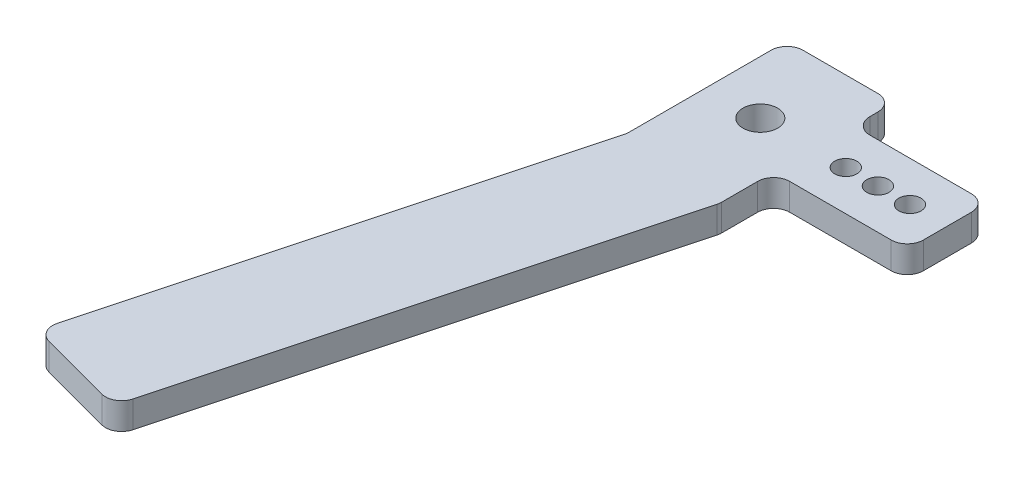
ISO-10303-21;
HEADER;
FILE_DESCRIPTION(('STEP AP214'),'2;1');
FILE_NAME('part.step','',(''),(''),'','','');
FILE_SCHEMA(('AUTOMOTIVE_DESIGN { 1 0 10303 214 1 1 1 1 }'));
ENDSEC;
DATA;
#1=APPLICATION_CONTEXT('core data for automotive mechanical design processes');
#2=APPLICATION_PROTOCOL_DEFINITION('international standard','automotive_design',2000,#1);
#3=PRODUCT_CONTEXT('',#1,'mechanical');
#4=PRODUCT('Part','Part','',(#3));
#5=PRODUCT_RELATED_PRODUCT_CATEGORY('part','',(#4));
#6=PRODUCT_DEFINITION_FORMATION('','',#4);
#7=PRODUCT_DEFINITION_CONTEXT('part definition',#1,'design');
#8=PRODUCT_DEFINITION('design','',#6,#7);
#9=PRODUCT_DEFINITION_SHAPE('','',#8);
#10=(LENGTH_UNIT() NAMED_UNIT(*) SI_UNIT(.MILLI.,.METRE.));
#11=(NAMED_UNIT(*) PLANE_ANGLE_UNIT() SI_UNIT($,.RADIAN.));
#12=(NAMED_UNIT(*) SI_UNIT($,.STERADIAN.) SOLID_ANGLE_UNIT());
#13=UNCERTAINTY_MEASURE_WITH_UNIT(LENGTH_MEASURE(1.E-05),#10,'distance_accuracy_value','');
#14=(GEOMETRIC_REPRESENTATION_CONTEXT(3) GLOBAL_UNCERTAINTY_ASSIGNED_CONTEXT((#13)) GLOBAL_UNIT_ASSIGNED_CONTEXT((#10,
#11,#12)) REPRESENTATION_CONTEXT('',''));
#15=CARTESIAN_POINT('',(0.,0.,0.));
#16=DIRECTION('',(0.,0.,1.));
#17=DIRECTION('',(1.,0.,0.));
#18=AXIS2_PLACEMENT_3D('',#15,#16,#17);
#19=CARTESIAN_POINT('',(-39.15,5.,-15.));
#20=DIRECTION('',(-1.,0.,0.));
#21=DIRECTION('',(0.,0.,1.));
#22=AXIS2_PLACEMENT_3D('',#19,#20,#21);
#23=PLANE('',#22);
#24=DIRECTION('',(0.,0.,-1.));
#25=VECTOR('',#24,1.);
#26=CARTESIAN_POINT('',(-39.15,0.,-15.));
#27=LINE('',#26,#25);
#28=CARTESIAN_POINT('',(-39.15,0.,17.2380924589857));
#29=VERTEX_POINT('',#28);
#30=CARTESIAN_POINT('',(-39.15,0.,10.5));
#31=VERTEX_POINT('',#30);
#32=EDGE_CURVE('E319',#29,#31,#27,.T.);
#33=ORIENTED_EDGE('',*,*,#32,.T.);
#34=DIRECTION('',(0.,-1.,0.));
#35=VECTOR('',#34,1.);
#36=CARTESIAN_POINT('',(-39.15,5.,10.5));
#37=LINE('',#36,#35);
#38=CARTESIAN_POINT('',(-39.15,5.,10.5));
#39=VERTEX_POINT('',#38);
#40=EDGE_CURVE('E241',#31,#39,#37,.F.);
#41=ORIENTED_EDGE('',*,*,#40,.T.);
#42=DIRECTION('',(0.,0.,-1.));
#43=VECTOR('',#42,1.);
#44=CARTESIAN_POINT('',(-39.15,5.,15.));
#45=LINE('',#44,#43);
#46=CARTESIAN_POINT('',(-39.15,5.,17.2380924589857));
#47=VERTEX_POINT('',#46);
#48=EDGE_CURVE('E330',#47,#39,#45,.T.);
#49=ORIENTED_EDGE('',*,*,#48,.F.);
#50=DIRECTION('',(0.,-1.,0.));
#51=VECTOR('',#50,1.);
#52=CARTESIAN_POINT('',(-39.15,5.,17.2380924589857));
#53=LINE('',#52,#51);
#54=EDGE_CURVE('E238',#47,#29,#53,.T.);
#55=ORIENTED_EDGE('',*,*,#54,.T.);
#56=EDGE_LOOP('',(#33,#41,#49,#55));
#57=FACE_BOUND('',#56,.T.);
#58=ADVANCED_FACE('F37',(#57),#23,.F.);
#59=CARTESIAN_POINT('',(0.,5.,0.));
#60=DIRECTION('',(0.,1.,0.));
#61=DIRECTION('',(0.,0.,1.));
#62=AXIS2_PLACEMENT_3D('',#59,#60,#61);
#63=PLANE('',#62);
#64=DIRECTION('',(0.,0.,-1.));
#65=VECTOR('',#64,1.);
#66=CARTESIAN_POINT('',(-14.15,5.,0.));
#67=LINE('',#66,#65);
#68=CARTESIAN_POINT('',(-14.15,5.,4.5));
#69=VERTEX_POINT('',#68);
#70=CARTESIAN_POINT('',(-14.15,5.,-4.5));
#71=VERTEX_POINT('',#70);
#72=EDGE_CURVE('E182',#69,#71,#67,.T.);
#73=ORIENTED_EDGE('',*,*,#72,.T.);
#74=CARTESIAN_POINT('',(-17.15,5.,-4.5));
#75=DIRECTION('',(0.,1.,0.));
#76=DIRECTION('',(0.,0.,1.));
#77=AXIS2_PLACEMENT_3D('',#74,#75,#76);
#78=CIRCLE('',#77,3.);
#79=CARTESIAN_POINT('',(-17.15,5.,-7.5));
#80=VERTEX_POINT('',#79);
#81=EDGE_CURVE('E175',#71,#80,#78,.T.);
#82=ORIENTED_EDGE('',*,*,#81,.T.);
#83=DIRECTION('',(-1.,0.,0.));
#84=VECTOR('',#83,1.);
#85=CARTESIAN_POINT('',(0.,5.,-7.5));
#86=LINE('',#85,#84);
#87=CARTESIAN_POINT('',(-36.15,5.,-7.5));
#88=VERTEX_POINT('',#87);
#89=EDGE_CURVE('E179',#80,#88,#86,.T.);
#90=ORIENTED_EDGE('',*,*,#89,.T.);
#91=CARTESIAN_POINT('',(-36.15,5.,-10.5));
#92=DIRECTION('',(0.,1.,0.));
#93=DIRECTION('',(0.,0.,1.));
#94=AXIS2_PLACEMENT_3D('',#91,#92,#93);
#95=CIRCLE('',#94,3.);
#96=CARTESIAN_POINT('',(-39.1500000000001,5.,-10.5));
#97=VERTEX_POINT('',#96);
#98=EDGE_CURVE('E278',#88,#97,#95,.F.);
#99=ORIENTED_EDGE('',*,*,#98,.T.);
#100=CARTESIAN_POINT('',(-39.1500000000001,5.,-12.));
#101=VERTEX_POINT('',#100);
#102=EDGE_CURVE('E327',#97,#101,#45,.T.);
#103=ORIENTED_EDGE('',*,*,#102,.T.);
#104=CARTESIAN_POINT('',(-42.15,5.,-12.));
#105=DIRECTION('',(0.,1.,0.));
#106=DIRECTION('',(0.,0.,1.));
#107=AXIS2_PLACEMENT_3D('',#104,#105,#106);
#108=CIRCLE('',#107,3.);
#109=CARTESIAN_POINT('',(-42.15,5.,-15.));
#110=VERTEX_POINT('',#109);
#111=EDGE_CURVE('E229',#101,#110,#108,.T.);
#112=ORIENTED_EDGE('',*,*,#111,.T.);
#113=DIRECTION('',(-1.,0.,0.));
#114=VECTOR('',#113,1.);
#115=CARTESIAN_POINT('',(-59.15,5.,-15.));
#116=LINE('',#115,#114);
#117=CARTESIAN_POINT('',(-56.15,5.,-15.));
#118=VERTEX_POINT('',#117);
#119=EDGE_CURVE('E311',#110,#118,#116,.T.);
#120=ORIENTED_EDGE('',*,*,#119,.T.);
#121=CARTESIAN_POINT('',(-56.15,5.,-12.));
#122=DIRECTION('',(0.,1.,0.));
#123=DIRECTION('',(0.,0.,1.));
#124=AXIS2_PLACEMENT_3D('',#121,#122,#123);
#125=CIRCLE('',#124,3.);
#126=CARTESIAN_POINT('',(-59.15,5.,-12.));
#127=VERTEX_POINT('',#126);
#128=EDGE_CURVE('E231',#118,#127,#125,.T.);
#129=ORIENTED_EDGE('',*,*,#128,.T.);
#130=DIRECTION('',(0.,0.,1.));
#131=VECTOR('',#130,1.);
#132=CARTESIAN_POINT('',(-59.15,5.,-15.));
#133=LINE('',#132,#131);
#134=CARTESIAN_POINT('',(-59.15,5.,14.6050425072378));
#135=VERTEX_POINT('',#134);
#136=EDGE_CURVE('E304',#127,#135,#133,.T.);
#137=ORIENTED_EDGE('',*,*,#136,.T.);
#138=CARTESIAN_POINT('',(-62.15,5.,14.6050425072378));
#139=DIRECTION('',(0.,1.,0.));
#140=DIRECTION('',(0.,0.,1.));
#141=AXIS2_PLACEMENT_3D('',#138,#139,#140);
#142=CIRCLE('',#141,3.);
#143=CARTESIAN_POINT('',(-59.2522225211328,5.,15.3814996425454));
#144=VERTEX_POINT('',#143);
#145=EDGE_CURVE('E11',#135,#144,#142,.F.);
#146=ORIENTED_EDGE('',*,*,#145,.T.);
#147=DIRECTION('',(-0.258819045102521,0.,0.965925826289068));
#148=VECTOR('',#147,1.);
#149=CARTESIAN_POINT('',(-59.15,5.,15.));
#150=LINE('',#149,#148);
#151=CARTESIAN_POINT('',(-81.6672569239194,5.,99.0355468871489));
#152=VERTEX_POINT('',#151);
#153=EDGE_CURVE('E302',#144,#152,#150,.T.);
#154=ORIENTED_EDGE('',*,*,#153,.T.);
#155=CARTESIAN_POINT('',(-78.7694794450521,5.,99.8120040224565));
#156=DIRECTION('',(0.,1.,0.));
#157=DIRECTION('',(0.,0.,1.));
#158=AXIS2_PLACEMENT_3D('',#155,#156,#157);
#159=CIRCLE('',#158,3.);
#160=CARTESIAN_POINT('',(-79.5459365803597,5.,102.709781501324));
#161=VERTEX_POINT('',#160);
#162=EDGE_CURVE('E225',#152,#161,#159,.T.);
#163=ORIENTED_EDGE('',*,*,#162,.T.);
#164=DIRECTION('',(0.965925826289068,0.,0.25881904510252));
#165=VECTOR('',#164,1.);
#166=CARTESIAN_POINT('',(-82.4437140592269,5.,101.933324366016));
#167=LINE('',#166,#165);
#168=CARTESIAN_POINT('',(-66.0229750123128,5.,106.333248132759));
#169=VERTEX_POINT('',#168);
#170=EDGE_CURVE('E308',#161,#169,#167,.T.);
#171=ORIENTED_EDGE('',*,*,#170,.T.);
#172=CARTESIAN_POINT('',(-65.2465178770052,5.,103.435470653892));
#173=DIRECTION('',(0.,1.,0.));
#174=DIRECTION('',(0.,0.,1.));
#175=AXIS2_PLACEMENT_3D('',#172,#173,#174);
#176=CIRCLE('',#175,3.);
#177=CARTESIAN_POINT('',(-62.348740398138,5.,104.211927789199));
#178=VERTEX_POINT('',#177);
#179=EDGE_CURVE('E59',#169,#178,#176,.T.);
#180=ORIENTED_EDGE('',*,*,#179,.T.);
#181=DIRECTION('',(0.258819045102521,0.,-0.965925826289068));
#182=VECTOR('',#181,1.);
#183=CARTESIAN_POINT('',(-39.8314834742186,5.,20.1763809020504));
#184=LINE('',#183,#182);
#185=CARTESIAN_POINT('',(-39.2522225211328,5.,18.0145495942933));
#186=VERTEX_POINT('',#185);
#187=EDGE_CURVE('E205',#178,#186,#184,.T.);
#188=ORIENTED_EDGE('',*,*,#187,.T.);
#189=CARTESIAN_POINT('',(-42.15,5.,17.2380924589857));
#190=DIRECTION('',(0.,1.,0.));
#191=DIRECTION('',(0.,0.,1.));
#192=AXIS2_PLACEMENT_3D('',#189,#190,#191);
#193=CIRCLE('',#192,3.);
#194=EDGE_CURVE('E227',#186,#47,#193,.T.);
#195=ORIENTED_EDGE('',*,*,#194,.T.);
#196=ORIENTED_EDGE('',*,*,#48,.T.);
#197=CARTESIAN_POINT('',(-36.15,5.,10.5));
#198=DIRECTION('',(0.,1.,0.));
#199=DIRECTION('',(0.,0.,1.));
#200=AXIS2_PLACEMENT_3D('',#197,#198,#199);
#201=CIRCLE('',#200,3.);
#202=CARTESIAN_POINT('',(-36.15,5.,7.49999999999999));
#203=VERTEX_POINT('',#202);
#204=EDGE_CURVE('E274',#39,#203,#201,.F.);
#205=ORIENTED_EDGE('',*,*,#204,.T.);
#206=DIRECTION('',(-1.,0.,0.));
#207=VECTOR('',#206,1.);
#208=CARTESIAN_POINT('',(0.,5.,7.5));
#209=LINE('',#208,#207);
#210=CARTESIAN_POINT('',(-17.15,5.,7.5));
#211=VERTEX_POINT('',#210);
#212=EDGE_CURVE('E358',#211,#203,#209,.T.);
#213=ORIENTED_EDGE('',*,*,#212,.F.);
#214=CARTESIAN_POINT('',(-17.15,5.,4.5));
#215=DIRECTION('',(0.,1.,0.));
#216=DIRECTION('',(0.,0.,1.));
#217=AXIS2_PLACEMENT_3D('',#214,#215,#216);
#218=CIRCLE('',#217,3.);
#219=EDGE_CURVE('E187',#211,#69,#218,.T.);
#220=ORIENTED_EDGE('',*,*,#219,.T.);
#221=EDGE_LOOP('',(#73,#82,#90,#99,#103,#112,#120,#129,#137,#146,#154,#163,#171,#180,#188,#195,
#196,#205,#213,#220));
#222=FACE_BOUND('',#221,.T.);
#223=CARTESIAN_POINT('',(-49.15,5.,0.));
#224=DIRECTION('',(0.,1.,0.));
#225=DIRECTION('',(0.,0.,1.));
#226=AXIS2_PLACEMENT_3D('',#223,#224,#225);
#227=CIRCLE('',#226,3.25);
#228=CARTESIAN_POINT('',(-49.15,5.,3.25));
#229=VERTEX_POINT('',#228);
#230=EDGE_CURVE('E320',#229,#229,#227,.T.);
#231=ORIENTED_EDGE('',*,*,#230,.F.);
#232=EDGE_LOOP('',(#231));
#233=FACE_BOUND('',#232,.T.);
#234=CARTESIAN_POINT('',(-27.15,5.,0.));
#235=DIRECTION('',(0.,1.,0.));
#236=DIRECTION('',(0.,0.,1.));
#237=AXIS2_PLACEMENT_3D('',#234,#235,#236);
#238=CIRCLE('',#237,2.075);
#239=CARTESIAN_POINT('',(-27.15,5.,2.075));
#240=VERTEX_POINT('',#239);
#241=EDGE_CURVE('E380',#240,#240,#238,.F.);
#242=ORIENTED_EDGE('',*,*,#241,.T.);
#243=EDGE_LOOP('',(#242));
#244=FACE_BOUND('',#243,.T.);
#245=CARTESIAN_POINT('',(-21.15,5.,0.));
#246=DIRECTION('',(0.,1.,0.));
#247=DIRECTION('',(0.,0.,1.));
#248=AXIS2_PLACEMENT_3D('',#245,#246,#247);
#249=CIRCLE('',#248,2.075);
#250=CARTESIAN_POINT('',(-21.15,5.,2.075));
#251=VERTEX_POINT('',#250);
#252=EDGE_CURVE('E197',#251,#251,#249,.F.);
#253=ORIENTED_EDGE('',*,*,#252,.T.);
#254=EDGE_LOOP('',(#253));
#255=FACE_BOUND('',#254,.T.);
#256=CARTESIAN_POINT('',(-33.15,5.,0.));
#257=DIRECTION('',(0.,1.,0.));
#258=DIRECTION('',(0.,0.,1.));
#259=AXIS2_PLACEMENT_3D('',#256,#257,#258);
#260=CIRCLE('',#259,2.075);
#261=CARTESIAN_POINT('',(-33.15,5.,2.075));
#262=VERTEX_POINT('',#261);
#263=EDGE_CURVE('E375',#262,#262,#260,.F.);
#264=ORIENTED_EDGE('',*,*,#263,.T.);
#265=EDGE_LOOP('',(#264));
#266=FACE_BOUND('',#265,.T.);
#267=ADVANCED_FACE('F177',(#222,#233,#244,#255,#266),#63,.T.);
#268=CARTESIAN_POINT('',(0.,0.,0.));
#269=DIRECTION('',(0.,1.,0.));
#270=DIRECTION('',(0.,0.,1.));
#271=AXIS2_PLACEMENT_3D('',#268,#269,#270);
#272=PLANE('',#271);
#273=DIRECTION('',(-1.,0.,0.));
#274=VECTOR('',#273,1.);
#275=CARTESIAN_POINT('',(0.,0.,-7.5));
#276=LINE('',#275,#274);
#277=CARTESIAN_POINT('',(-17.15,0.,-7.5));
#278=VERTEX_POINT('',#277);
#279=CARTESIAN_POINT('',(-36.15,0.,-7.5));
#280=VERTEX_POINT('',#279);
#281=EDGE_CURVE('E357',#278,#280,#276,.T.);
#282=ORIENTED_EDGE('',*,*,#281,.F.);
#283=CARTESIAN_POINT('',(-17.15,0.,-4.5));
#284=DIRECTION('',(0.,1.,0.));
#285=DIRECTION('',(0.,0.,1.));
#286=AXIS2_PLACEMENT_3D('',#283,#284,#285);
#287=CIRCLE('',#286,3.);
#288=CARTESIAN_POINT('',(-14.15,0.,-4.5));
#289=VERTEX_POINT('',#288);
#290=EDGE_CURVE('E200',#278,#289,#287,.F.);
#291=ORIENTED_EDGE('',*,*,#290,.T.);
#292=DIRECTION('',(0.,0.,-1.));
#293=VECTOR('',#292,1.);
#294=CARTESIAN_POINT('',(-14.15,0.,0.));
#295=LINE('',#294,#293);
#296=CARTESIAN_POINT('',(-14.15,0.,4.5));
#297=VERTEX_POINT('',#296);
#298=EDGE_CURVE('E365',#297,#289,#295,.T.);
#299=ORIENTED_EDGE('',*,*,#298,.F.);
#300=CARTESIAN_POINT('',(-17.15,0.,4.5));
#301=DIRECTION('',(0.,1.,0.));
#302=DIRECTION('',(0.,0.,1.));
#303=AXIS2_PLACEMENT_3D('',#300,#301,#302);
#304=CIRCLE('',#303,3.);
#305=CARTESIAN_POINT('',(-17.15,0.,7.5));
#306=VERTEX_POINT('',#305);
#307=EDGE_CURVE('E216',#297,#306,#304,.F.);
#308=ORIENTED_EDGE('',*,*,#307,.T.);
#309=DIRECTION('',(-1.,0.,0.));
#310=VECTOR('',#309,1.);
#311=CARTESIAN_POINT('',(0.,0.,7.5));
#312=LINE('',#311,#310);
#313=CARTESIAN_POINT('',(-36.15,0.,7.49999999999999));
#314=VERTEX_POINT('',#313);
#315=EDGE_CURVE('E382',#306,#314,#312,.T.);
#316=ORIENTED_EDGE('',*,*,#315,.T.);
#317=CARTESIAN_POINT('',(-36.15,0.,10.5));
#318=DIRECTION('',(0.,1.,0.));
#319=DIRECTION('',(0.,0.,1.));
#320=AXIS2_PLACEMENT_3D('',#317,#318,#319);
#321=CIRCLE('',#320,3.);
#322=EDGE_CURVE('E272',#314,#31,#321,.T.);
#323=ORIENTED_EDGE('',*,*,#322,.T.);
#324=ORIENTED_EDGE('',*,*,#32,.F.);
#325=CARTESIAN_POINT('',(-42.15,0.,17.2380924589857));
#326=DIRECTION('',(0.,1.,0.));
#327=DIRECTION('',(0.,0.,1.));
#328=AXIS2_PLACEMENT_3D('',#325,#326,#327);
#329=CIRCLE('',#328,3.);
#330=CARTESIAN_POINT('',(-39.2522225211328,0.,18.0145495942933));
#331=VERTEX_POINT('',#330);
#332=EDGE_CURVE('E210',#29,#331,#329,.F.);
#333=ORIENTED_EDGE('',*,*,#332,.T.);
#334=DIRECTION('',(0.258819045102522,0.,-0.965925826289068));
#335=VECTOR('',#334,1.);
#336=CARTESIAN_POINT('',(-39.8314834742186,0.,20.1763809020504));
#337=LINE('',#336,#335);
#338=CARTESIAN_POINT('',(-62.348740398138,0.,104.211927789199));
#339=VERTEX_POINT('',#338);
#340=EDGE_CURVE('E326',#339,#331,#337,.T.);
#341=ORIENTED_EDGE('',*,*,#340,.F.);
#342=CARTESIAN_POINT('',(-65.2465178770052,0.,103.435470653892));
#343=DIRECTION('',(0.,1.,0.));
#344=DIRECTION('',(0.,0.,1.));
#345=AXIS2_PLACEMENT_3D('',#342,#343,#344);
#346=CIRCLE('',#345,3.);
#347=CARTESIAN_POINT('',(-66.0229750123128,0.,106.333248132759));
#348=VERTEX_POINT('',#347);
#349=EDGE_CURVE('E201',#339,#348,#346,.F.);
#350=ORIENTED_EDGE('',*,*,#349,.T.);
#351=DIRECTION('',(0.965925826289068,0.,0.25881904510252));
#352=VECTOR('',#351,1.);
#353=CARTESIAN_POINT('',(-82.4437140592269,0.,101.933324366016));
#354=LINE('',#353,#352);
#355=CARTESIAN_POINT('',(-79.5459365803597,0.,102.709781501324));
#356=VERTEX_POINT('',#355);
#357=EDGE_CURVE('E324',#356,#348,#354,.T.);
#358=ORIENTED_EDGE('',*,*,#357,.F.);
#359=CARTESIAN_POINT('',(-78.7694794450521,0.,99.8120040224565));
#360=DIRECTION('',(0.,1.,0.));
#361=DIRECTION('',(0.,0.,1.));
#362=AXIS2_PLACEMENT_3D('',#359,#360,#361);
#363=CIRCLE('',#362,3.);
#364=CARTESIAN_POINT('',(-81.6672569239194,0.,99.0355468871489));
#365=VERTEX_POINT('',#364);
#366=EDGE_CURVE('E203',#356,#365,#363,.F.);
#367=ORIENTED_EDGE('',*,*,#366,.T.);
#368=DIRECTION('',(-0.258819045102521,0.,0.965925826289068));
#369=VECTOR('',#368,1.);
#370=CARTESIAN_POINT('',(-59.15,0.,15.));
#371=LINE('',#370,#369);
#372=CARTESIAN_POINT('',(-59.2522225211328,0.,15.3814996425454));
#373=VERTEX_POINT('',#372);
#374=EDGE_CURVE('E287',#373,#365,#371,.T.);
#375=ORIENTED_EDGE('',*,*,#374,.F.);
#376=CARTESIAN_POINT('',(-62.15,0.,14.6050425072378));
#377=DIRECTION('',(0.,1.,0.));
#378=DIRECTION('',(0.,0.,1.));
#379=AXIS2_PLACEMENT_3D('',#376,#377,#378);
#380=CIRCLE('',#379,3.);
#381=CARTESIAN_POINT('',(-59.15,0.,14.6050425072378));
#382=VERTEX_POINT('',#381);
#383=EDGE_CURVE('E45',#373,#382,#380,.T.);
#384=ORIENTED_EDGE('',*,*,#383,.T.);
#385=DIRECTION('',(0.,0.,1.));
#386=VECTOR('',#385,1.);
#387=CARTESIAN_POINT('',(-59.15,0.,-15.));
#388=LINE('',#387,#386);
#389=CARTESIAN_POINT('',(-59.15,0.,-12.));
#390=VERTEX_POINT('',#389);
#391=EDGE_CURVE('E285',#390,#382,#388,.T.);
#392=ORIENTED_EDGE('',*,*,#391,.F.);
#393=CARTESIAN_POINT('',(-56.15,0.,-12.));
#394=DIRECTION('',(0.,1.,0.));
#395=DIRECTION('',(0.,0.,1.));
#396=AXIS2_PLACEMENT_3D('',#393,#394,#395);
#397=CIRCLE('',#396,3.);
#398=CARTESIAN_POINT('',(-56.15,0.,-15.));
#399=VERTEX_POINT('',#398);
#400=EDGE_CURVE('E214',#390,#399,#397,.F.);
#401=ORIENTED_EDGE('',*,*,#400,.T.);
#402=DIRECTION('',(-1.,0.,0.));
#403=VECTOR('',#402,1.);
#404=CARTESIAN_POINT('',(-59.15,0.,-15.));
#405=LINE('',#404,#403);
#406=CARTESIAN_POINT('',(-42.15,0.,-15.));
#407=VERTEX_POINT('',#406);
#408=EDGE_CURVE('E296',#407,#399,#405,.T.);
#409=ORIENTED_EDGE('',*,*,#408,.F.);
#410=CARTESIAN_POINT('',(-42.15,0.,-12.));
#411=DIRECTION('',(0.,1.,0.));
#412=DIRECTION('',(0.,0.,1.));
#413=AXIS2_PLACEMENT_3D('',#410,#411,#412);
#414=CIRCLE('',#413,3.);
#415=CARTESIAN_POINT('',(-39.15,0.,-12.));
#416=VERTEX_POINT('',#415);
#417=EDGE_CURVE('E212',#407,#416,#414,.F.);
#418=ORIENTED_EDGE('',*,*,#417,.T.);
#419=CARTESIAN_POINT('',(-39.15,0.,-10.5));
#420=VERTEX_POINT('',#419);
#421=EDGE_CURVE('E316',#420,#416,#27,.T.);
#422=ORIENTED_EDGE('',*,*,#421,.F.);
#423=CARTESIAN_POINT('',(-36.15,0.,-10.5));
#424=DIRECTION('',(0.,1.,0.));
#425=DIRECTION('',(0.,0.,1.));
#426=AXIS2_PLACEMENT_3D('',#423,#424,#425);
#427=CIRCLE('',#426,3.);
#428=EDGE_CURVE('E276',#420,#280,#427,.T.);
#429=ORIENTED_EDGE('',*,*,#428,.T.);
#430=EDGE_LOOP('',(#282,#291,#299,#308,#316,#323,#324,#333,#341,#350,#358,#367,#375,#384,#392,
#401,#409,#418,#422,#429));
#431=FACE_BOUND('',#430,.T.);
#432=CARTESIAN_POINT('',(-49.15,0.,0.));
#433=DIRECTION('',(0.,1.,0.));
#434=DIRECTION('',(0.,0.,1.));
#435=AXIS2_PLACEMENT_3D('',#432,#433,#434);
#436=CIRCLE('',#435,3.25);
#437=CARTESIAN_POINT('',(-49.15,0.,3.25));
#438=VERTEX_POINT('',#437);
#439=EDGE_CURVE('E336',#438,#438,#436,.T.);
#440=ORIENTED_EDGE('',*,*,#439,.T.);
#441=EDGE_LOOP('',(#440));
#442=FACE_BOUND('',#441,.T.);
#443=CARTESIAN_POINT('',(-21.15,0.,0.));
#444=DIRECTION('',(0.,-1.,0.));
#445=DIRECTION('',(0.,0.,-1.));
#446=AXIS2_PLACEMENT_3D('',#443,#444,#445);
#447=CIRCLE('',#446,2.075);
#448=CARTESIAN_POINT('',(-21.15,0.,-2.075));
#449=VERTEX_POINT('',#448);
#450=EDGE_CURVE('E372',#449,#449,#447,.T.);
#451=ORIENTED_EDGE('',*,*,#450,.F.);
#452=EDGE_LOOP('',(#451));
#453=FACE_BOUND('',#452,.T.);
#454=CARTESIAN_POINT('',(-27.15,0.,0.));
#455=DIRECTION('',(0.,-1.,0.));
#456=DIRECTION('',(0.,0.,-1.));
#457=AXIS2_PLACEMENT_3D('',#454,#455,#456);
#458=CIRCLE('',#457,2.075);
#459=CARTESIAN_POINT('',(-27.15,0.,-2.075));
#460=VERTEX_POINT('',#459);
#461=EDGE_CURVE('E369',#460,#460,#458,.T.);
#462=ORIENTED_EDGE('',*,*,#461,.F.);
#463=EDGE_LOOP('',(#462));
#464=FACE_BOUND('',#463,.T.);
#465=CARTESIAN_POINT('',(-33.15,0.,0.));
#466=DIRECTION('',(0.,-1.,0.));
#467=DIRECTION('',(0.,0.,-1.));
#468=AXIS2_PLACEMENT_3D('',#465,#466,#467);
#469=CIRCLE('',#468,2.075);
#470=CARTESIAN_POINT('',(-33.15,0.,-2.075));
#471=VERTEX_POINT('',#470);
#472=EDGE_CURVE('E361',#471,#471,#469,.T.);
#473=ORIENTED_EDGE('',*,*,#472,.F.);
#474=EDGE_LOOP('',(#473));
#475=FACE_BOUND('',#474,.T.);
#476=ADVANCED_FACE('F283',(#431,#442,#453,#464,#475),#272,.F.);
#477=ORIENTED_EDGE('',*,*,#102,.F.);
#478=DIRECTION('',(0.,-1.,0.));
#479=VECTOR('',#478,1.);
#480=CARTESIAN_POINT('',(-39.15,0.,-10.5));
#481=LINE('',#480,#479);
#482=EDGE_CURVE('E245',#97,#420,#481,.T.);
#483=ORIENTED_EDGE('',*,*,#482,.T.);
#484=ORIENTED_EDGE('',*,*,#421,.T.);
#485=DIRECTION('',(0.,-1.,0.));
#486=VECTOR('',#485,1.);
#487=CARTESIAN_POINT('',(-39.15,5.,-12.));
#488=LINE('',#487,#486);
#489=EDGE_CURVE('E243',#416,#101,#488,.F.);
#490=ORIENTED_EDGE('',*,*,#489,.T.);
#491=EDGE_LOOP('',(#477,#483,#484,#490));
#492=FACE_BOUND('',#491,.T.);
#493=ADVANCED_FACE('F353',(#492),#23,.F.);
#494=CARTESIAN_POINT('',(-59.15,5.,-15.));
#495=DIRECTION('',(0.,0.,1.));
#496=DIRECTION('',(1.,0.,0.));
#497=AXIS2_PLACEMENT_3D('',#494,#495,#496);
#498=PLANE('',#497);
#499=ORIENTED_EDGE('',*,*,#408,.T.);
#500=DIRECTION('',(0.,-1.,0.));
#501=VECTOR('',#500,1.);
#502=CARTESIAN_POINT('',(-56.15,5.,-15.));
#503=LINE('',#502,#501);
#504=EDGE_CURVE('E261',#399,#118,#503,.F.);
#505=ORIENTED_EDGE('',*,*,#504,.T.);
#506=ORIENTED_EDGE('',*,*,#119,.F.);
#507=DIRECTION('',(0.,-1.,0.));
#508=VECTOR('',#507,1.);
#509=CARTESIAN_POINT('',(-42.15,5.,-15.));
#510=LINE('',#509,#508);
#511=EDGE_CURVE('E258',#110,#407,#510,.T.);
#512=ORIENTED_EDGE('',*,*,#511,.T.);
#513=EDGE_LOOP('',(#499,#505,#506,#512));
#514=FACE_BOUND('',#513,.T.);
#515=ADVANCED_FACE('F347',(#514),#498,.F.);
#516=CARTESIAN_POINT('',(-59.15,5.,-15.));
#517=DIRECTION('',(1.,0.,0.));
#518=DIRECTION('',(0.,0.,-1.));
#519=AXIS2_PLACEMENT_3D('',#516,#517,#518);
#520=PLANE('',#519);
#521=ORIENTED_EDGE('',*,*,#391,.T.);
#522=DIRECTION('',(0.,-1.,0.));
#523=VECTOR('',#522,1.);
#524=CARTESIAN_POINT('',(-59.15,5.,14.6050425072378));
#525=LINE('',#524,#523);
#526=EDGE_CURVE('E256',#382,#135,#525,.F.);
#527=ORIENTED_EDGE('',*,*,#526,.T.);
#528=ORIENTED_EDGE('',*,*,#136,.F.);
#529=DIRECTION('',(0.,-1.,0.));
#530=VECTOR('',#529,1.);
#531=CARTESIAN_POINT('',(-59.15,5.,-12.));
#532=LINE('',#531,#530);
#533=EDGE_CURVE('E253',#127,#390,#532,.T.);
#534=ORIENTED_EDGE('',*,*,#533,.T.);
#535=EDGE_LOOP('',(#521,#527,#528,#534));
#536=FACE_BOUND('',#535,.T.);
#537=ADVANCED_FACE('F292',(#536),#520,.F.);
#538=CARTESIAN_POINT('',(-59.15,5.,15.));
#539=DIRECTION('',(0.965925826289068,0.,0.258819045102521));
#540=DIRECTION('',(0.258819045102521,0.,-0.965925826289068));
#541=AXIS2_PLACEMENT_3D('',#538,#539,#540);
#542=PLANE('',#541);
#543=ORIENTED_EDGE('',*,*,#153,.F.);
#544=DIRECTION('',(0.,-1.,0.));
#545=VECTOR('',#544,1.);
#546=CARTESIAN_POINT('',(-59.2522225211328,0.,15.3814996425454));
#547=LINE('',#546,#545);
#548=EDGE_CURVE('E250',#144,#373,#547,.T.);
#549=ORIENTED_EDGE('',*,*,#548,.T.);
#550=ORIENTED_EDGE('',*,*,#374,.T.);
#551=DIRECTION('',(0.,-1.,0.));
#552=VECTOR('',#551,1.);
#553=CARTESIAN_POINT('',(-81.6672569239194,5.,99.035546887149));
#554=LINE('',#553,#552);
#555=EDGE_CURVE('E248',#365,#152,#554,.F.);
#556=ORIENTED_EDGE('',*,*,#555,.T.);
#557=EDGE_LOOP('',(#543,#549,#550,#556));
#558=FACE_BOUND('',#557,.T.);
#559=ADVANCED_FACE('F306',(#558),#542,.F.);
#560=CARTESIAN_POINT('',(-82.4437140592269,5.,101.933324366016));
#561=DIRECTION('',(0.25881904510252,0.,-0.965925826289069));
#562=DIRECTION('',(-0.965925826289069,0.,-0.25881904510252));
#563=AXIS2_PLACEMENT_3D('',#560,#561,#562);
#564=PLANE('',#563);
#565=ORIENTED_EDGE('',*,*,#170,.F.);
#566=DIRECTION('',(0.,-1.,0.));
#567=VECTOR('',#566,1.);
#568=CARTESIAN_POINT('',(-79.5459365803597,5.,102.709781501324));
#569=LINE('',#568,#567);
#570=EDGE_CURVE('E269',#161,#356,#569,.T.);
#571=ORIENTED_EDGE('',*,*,#570,.T.);
#572=ORIENTED_EDGE('',*,*,#357,.T.);
#573=DIRECTION('',(0.,-1.,0.));
#574=VECTOR('',#573,1.);
#575=CARTESIAN_POINT('',(-66.0229750123128,5.,106.333248132759));
#576=LINE('',#575,#574);
#577=EDGE_CURVE('E267',#348,#169,#576,.F.);
#578=ORIENTED_EDGE('',*,*,#577,.T.);
#579=EDGE_LOOP('',(#565,#571,#572,#578));
#580=FACE_BOUND('',#579,.T.);
#581=ADVANCED_FACE('F401',(#580),#564,.F.);
#582=CARTESIAN_POINT('',(-39.8314834742186,5.,20.1763809020504));
#583=DIRECTION('',(-0.965925826289068,0.,-0.258819045102522));
#584=DIRECTION('',(-0.258819045102522,0.,0.965925826289068));
#585=AXIS2_PLACEMENT_3D('',#582,#583,#584);
#586=PLANE('',#585);
#587=ORIENTED_EDGE('',*,*,#340,.T.);
#588=DIRECTION('',(0.,-1.,0.));
#589=VECTOR('',#588,1.);
#590=CARTESIAN_POINT('',(-39.2522225211328,5.,18.0145495942933));
#591=LINE('',#590,#589);
#592=EDGE_CURVE('E52',#331,#186,#591,.F.);
#593=ORIENTED_EDGE('',*,*,#592,.T.);
#594=ORIENTED_EDGE('',*,*,#187,.F.);
#595=DIRECTION('',(0.,-1.,0.));
#596=VECTOR('',#595,1.);
#597=CARTESIAN_POINT('',(-62.348740398138,5.,104.211927789199));
#598=LINE('',#597,#596);
#599=EDGE_CURVE('E263',#178,#339,#598,.T.);
#600=ORIENTED_EDGE('',*,*,#599,.T.);
#601=EDGE_LOOP('',(#587,#593,#594,#600));
#602=FACE_BOUND('',#601,.T.);
#603=ADVANCED_FACE('F393',(#602),#586,.F.);
#604=CARTESIAN_POINT('',(-49.15,5.,0.));
#605=DIRECTION('',(0.,-1.,0.));
#606=DIRECTION('',(0.,0.,-1.));
#607=AXIS2_PLACEMENT_3D('',#604,#605,#606);
#608=CYLINDRICAL_SURFACE('',#607,3.25);
#609=ORIENTED_EDGE('',*,*,#230,.T.);
#610=EDGE_LOOP('',(#609));
#611=FACE_BOUND('',#610,.T.);
#612=ORIENTED_EDGE('',*,*,#439,.F.);
#613=EDGE_LOOP('',(#612));
#614=FACE_BOUND('',#613,.T.);
#615=ADVANCED_FACE('F391',(#611,#614),#608,.F.);
#616=CARTESIAN_POINT('',(0.,34.1547594742265,-7.5));
#617=DIRECTION('',(0.,0.,1.));
#618=DIRECTION('',(1.,0.,0.));
#619=AXIS2_PLACEMENT_3D('',#616,#617,#618);
#620=PLANE('',#619);
#621=ORIENTED_EDGE('',*,*,#89,.F.);
#622=DIRECTION('',(0.,-1.,0.));
#623=VECTOR('',#622,1.);
#624=CARTESIAN_POINT('',(-17.15,34.1547594742265,-7.5));
#625=LINE('',#624,#623);
#626=EDGE_CURVE('E193',#80,#278,#625,.T.);
#627=ORIENTED_EDGE('',*,*,#626,.T.);
#628=ORIENTED_EDGE('',*,*,#281,.T.);
#629=DIRECTION('',(0.,-1.,0.));
#630=VECTOR('',#629,1.);
#631=CARTESIAN_POINT('',(-36.15,5.,-7.5));
#632=LINE('',#631,#630);
#633=EDGE_CURVE('E196',#280,#88,#632,.F.);
#634=ORIENTED_EDGE('',*,*,#633,.T.);
#635=EDGE_LOOP('',(#621,#627,#628,#634));
#636=FACE_BOUND('',#635,.T.);
#637=ADVANCED_FACE('F191',(#636),#620,.F.);
#638=CARTESIAN_POINT('',(0.,34.1547594742265,7.5));
#639=DIRECTION('',(0.,0.,1.));
#640=DIRECTION('',(1.,0.,0.));
#641=AXIS2_PLACEMENT_3D('',#638,#639,#640);
#642=PLANE('',#641);
#643=ORIENTED_EDGE('',*,*,#315,.F.);
#644=DIRECTION('',(0.,-1.,0.));
#645=VECTOR('',#644,1.);
#646=CARTESIAN_POINT('',(-17.15,5.,7.5));
#647=LINE('',#646,#645);
#648=EDGE_CURVE('E236',#306,#211,#647,.F.);
#649=ORIENTED_EDGE('',*,*,#648,.T.);
#650=ORIENTED_EDGE('',*,*,#212,.T.);
#651=DIRECTION('',(0.,-1.,0.));
#652=VECTOR('',#651,1.);
#653=CARTESIAN_POINT('',(-36.15,34.1547594742265,7.49999999999999));
#654=LINE('',#653,#652);
#655=EDGE_CURVE('E186',#203,#314,#654,.T.);
#656=ORIENTED_EDGE('',*,*,#655,.T.);
#657=EDGE_LOOP('',(#643,#649,#650,#656));
#658=FACE_BOUND('',#657,.T.);
#659=ADVANCED_FACE('F399',(#658),#642,.T.);
#660=CARTESIAN_POINT('',(-33.15,34.1547594742265,0.));
#661=DIRECTION('',(0.,-1.,0.));
#662=DIRECTION('',(0.,0.,-1.));
#663=AXIS2_PLACEMENT_3D('',#660,#661,#662);
#664=CYLINDRICAL_SURFACE('',#663,2.075);
#665=ORIENTED_EDGE('',*,*,#472,.T.);
#666=EDGE_LOOP('',(#665));
#667=FACE_BOUND('',#666,.T.);
#668=ORIENTED_EDGE('',*,*,#263,.F.);
#669=EDGE_LOOP('',(#668));
#670=FACE_BOUND('',#669,.T.);
#671=ADVANCED_FACE('F463',(#667,#670),#664,.F.);
#672=CARTESIAN_POINT('',(-27.15,34.1547594742265,0.));
#673=DIRECTION('',(0.,-1.,0.));
#674=DIRECTION('',(0.,0.,-1.));
#675=AXIS2_PLACEMENT_3D('',#672,#673,#674);
#676=CYLINDRICAL_SURFACE('',#675,2.075);
#677=ORIENTED_EDGE('',*,*,#461,.T.);
#678=EDGE_LOOP('',(#677));
#679=FACE_BOUND('',#678,.T.);
#680=ORIENTED_EDGE('',*,*,#241,.F.);
#681=EDGE_LOOP('',(#680));
#682=FACE_BOUND('',#681,.T.);
#683=ADVANCED_FACE('F593',(#679,#682),#676,.F.);
#684=CARTESIAN_POINT('',(-21.15,34.1547594742265,0.));
#685=DIRECTION('',(0.,-1.,0.));
#686=DIRECTION('',(0.,0.,-1.));
#687=AXIS2_PLACEMENT_3D('',#684,#685,#686);
#688=CYLINDRICAL_SURFACE('',#687,2.075);
#689=ORIENTED_EDGE('',*,*,#450,.T.);
#690=EDGE_LOOP('',(#689));
#691=FACE_BOUND('',#690,.T.);
#692=ORIENTED_EDGE('',*,*,#252,.F.);
#693=EDGE_LOOP('',(#692));
#694=FACE_BOUND('',#693,.T.);
#695=ADVANCED_FACE('F477',(#691,#694),#688,.F.);
#696=CARTESIAN_POINT('',(-14.15,34.1547594742265,0.));
#697=DIRECTION('',(-1.,0.,0.));
#698=DIRECTION('',(0.,0.,1.));
#699=AXIS2_PLACEMENT_3D('',#696,#697,#698);
#700=PLANE('',#699);
#701=ORIENTED_EDGE('',*,*,#298,.T.);
#702=DIRECTION('',(0.,-1.,0.));
#703=VECTOR('',#702,1.);
#704=CARTESIAN_POINT('',(-14.15,34.1547594742265,-4.5));
#705=LINE('',#704,#703);
#706=EDGE_CURVE('E222',#289,#71,#705,.F.);
#707=ORIENTED_EDGE('',*,*,#706,.T.);
#708=ORIENTED_EDGE('',*,*,#72,.F.);
#709=DIRECTION('',(0.,-1.,0.));
#710=VECTOR('',#709,1.);
#711=CARTESIAN_POINT('',(-14.15,0.,4.5));
#712=LINE('',#711,#710);
#713=EDGE_CURVE('E219',#69,#297,#712,.T.);
#714=ORIENTED_EDGE('',*,*,#713,.T.);
#715=EDGE_LOOP('',(#701,#707,#708,#714));
#716=FACE_BOUND('',#715,.T.);
#717=ADVANCED_FACE('F472',(#716),#700,.F.);
#718=CARTESIAN_POINT('',(-17.15,34.1547594742265,-4.5));
#719=DIRECTION('',(0.,-1.,0.));
#720=DIRECTION('',(0.,0.,-1.));
#721=AXIS2_PLACEMENT_3D('',#718,#719,#720);
#722=CYLINDRICAL_SURFACE('',#721,3.);
#723=ORIENTED_EDGE('',*,*,#81,.F.);
#724=ORIENTED_EDGE('',*,*,#706,.F.);
#725=ORIENTED_EDGE('',*,*,#290,.F.);
#726=ORIENTED_EDGE('',*,*,#626,.F.);
#727=EDGE_LOOP('',(#723,#724,#725,#726));
#728=FACE_BOUND('',#727,.T.);
#729=ADVANCED_FACE('F199',(#728),#722,.T.);
#730=CARTESIAN_POINT('',(-17.15,34.1547594742265,4.5));
#731=DIRECTION('',(0.,1.,0.));
#732=DIRECTION('',(0.,0.,1.));
#733=AXIS2_PLACEMENT_3D('',#730,#731,#732);
#734=CYLINDRICAL_SURFACE('',#733,3.);
#735=ORIENTED_EDGE('',*,*,#219,.F.);
#736=ORIENTED_EDGE('',*,*,#648,.F.);
#737=ORIENTED_EDGE('',*,*,#307,.F.);
#738=ORIENTED_EDGE('',*,*,#713,.F.);
#739=EDGE_LOOP('',(#735,#736,#737,#738));
#740=FACE_BOUND('',#739,.T.);
#741=ADVANCED_FACE('F489',(#740),#734,.T.);
#742=CARTESIAN_POINT('',(-36.15,34.1547594742265,10.5));
#743=DIRECTION('',(0.,-1.,0.));
#744=DIRECTION('',(0.,0.,-1.));
#745=AXIS2_PLACEMENT_3D('',#742,#743,#744);
#746=CYLINDRICAL_SURFACE('',#745,3.);
#747=ORIENTED_EDGE('',*,*,#204,.F.);
#748=ORIENTED_EDGE('',*,*,#40,.F.);
#749=ORIENTED_EDGE('',*,*,#322,.F.);
#750=ORIENTED_EDGE('',*,*,#655,.F.);
#751=EDGE_LOOP('',(#747,#748,#749,#750));
#752=FACE_BOUND('',#751,.T.);
#753=ADVANCED_FACE('F497',(#752),#746,.F.);
#754=CARTESIAN_POINT('',(-36.15,5.,-10.5));
#755=DIRECTION('',(0.,1.,0.));
#756=DIRECTION('',(0.,0.,1.));
#757=AXIS2_PLACEMENT_3D('',#754,#755,#756);
#758=CYLINDRICAL_SURFACE('',#757,3.);
#759=ORIENTED_EDGE('',*,*,#98,.F.);
#760=ORIENTED_EDGE('',*,*,#633,.F.);
#761=ORIENTED_EDGE('',*,*,#428,.F.);
#762=ORIENTED_EDGE('',*,*,#482,.F.);
#763=EDGE_LOOP('',(#759,#760,#761,#762));
#764=FACE_BOUND('',#763,.T.);
#765=ADVANCED_FACE('F356',(#764),#758,.F.);
#766=CARTESIAN_POINT('',(-62.15,5.,14.6050425072378));
#767=DIRECTION('',(0.,1.,0.));
#768=DIRECTION('',(0.,0.,1.));
#769=AXIS2_PLACEMENT_3D('',#766,#767,#768);
#770=CYLINDRICAL_SURFACE('',#769,3.);
#771=ORIENTED_EDGE('',*,*,#145,.F.);
#772=ORIENTED_EDGE('',*,*,#526,.F.);
#773=ORIENTED_EDGE('',*,*,#383,.F.);
#774=ORIENTED_EDGE('',*,*,#548,.F.);
#775=EDGE_LOOP('',(#771,#772,#773,#774));
#776=FACE_BOUND('',#775,.T.);
#777=ADVANCED_FACE('F299',(#776),#770,.F.);
#778=CARTESIAN_POINT('',(-56.15,5.,-12.));
#779=DIRECTION('',(0.,-1.,0.));
#780=DIRECTION('',(0.,0.,-1.));
#781=AXIS2_PLACEMENT_3D('',#778,#779,#780);
#782=CYLINDRICAL_SURFACE('',#781,3.);
#783=ORIENTED_EDGE('',*,*,#128,.F.);
#784=ORIENTED_EDGE('',*,*,#504,.F.);
#785=ORIENTED_EDGE('',*,*,#400,.F.);
#786=ORIENTED_EDGE('',*,*,#533,.F.);
#787=EDGE_LOOP('',(#783,#784,#785,#786));
#788=FACE_BOUND('',#787,.T.);
#789=ADVANCED_FACE('F345',(#788),#782,.T.);
#790=CARTESIAN_POINT('',(-42.15,5.,-12.));
#791=DIRECTION('',(0.,-1.,0.));
#792=DIRECTION('',(0.,0.,-1.));
#793=AXIS2_PLACEMENT_3D('',#790,#791,#792);
#794=CYLINDRICAL_SURFACE('',#793,3.);
#795=ORIENTED_EDGE('',*,*,#111,.F.);
#796=ORIENTED_EDGE('',*,*,#489,.F.);
#797=ORIENTED_EDGE('',*,*,#417,.F.);
#798=ORIENTED_EDGE('',*,*,#511,.F.);
#799=EDGE_LOOP('',(#795,#796,#797,#798));
#800=FACE_BOUND('',#799,.T.);
#801=ADVANCED_FACE('F349',(#800),#794,.T.);
#802=CARTESIAN_POINT('',(-42.15,5.,17.2380924589857));
#803=DIRECTION('',(0.,-1.,0.));
#804=DIRECTION('',(0.,0.,-1.));
#805=AXIS2_PLACEMENT_3D('',#802,#803,#804);
#806=CYLINDRICAL_SURFACE('',#805,3.);
#807=ORIENTED_EDGE('',*,*,#194,.F.);
#808=ORIENTED_EDGE('',*,*,#592,.F.);
#809=ORIENTED_EDGE('',*,*,#332,.F.);
#810=ORIENTED_EDGE('',*,*,#54,.F.);
#811=EDGE_LOOP('',(#807,#808,#809,#810));
#812=FACE_BOUND('',#811,.T.);
#813=ADVANCED_FACE('F540',(#812),#806,.T.);
#814=CARTESIAN_POINT('',(-78.7694794450521,5.,99.8120040224565));
#815=DIRECTION('',(0.,-1.,0.));
#816=DIRECTION('',(0.,0.,-1.));
#817=AXIS2_PLACEMENT_3D('',#814,#815,#816);
#818=CYLINDRICAL_SURFACE('',#817,3.);
#819=ORIENTED_EDGE('',*,*,#162,.F.);
#820=ORIENTED_EDGE('',*,*,#555,.F.);
#821=ORIENTED_EDGE('',*,*,#366,.F.);
#822=ORIENTED_EDGE('',*,*,#570,.F.);
#823=EDGE_LOOP('',(#819,#820,#821,#822));
#824=FACE_BOUND('',#823,.T.);
#825=ADVANCED_FACE('F549',(#824),#818,.T.);
#826=CARTESIAN_POINT('',(-65.2465178770052,5.,103.435470653892));
#827=DIRECTION('',(0.,-1.,0.));
#828=DIRECTION('',(0.,0.,-1.));
#829=AXIS2_PLACEMENT_3D('',#826,#827,#828);
#830=CYLINDRICAL_SURFACE('',#829,3.);
#831=ORIENTED_EDGE('',*,*,#179,.F.);
#832=ORIENTED_EDGE('',*,*,#577,.F.);
#833=ORIENTED_EDGE('',*,*,#349,.F.);
#834=ORIENTED_EDGE('',*,*,#599,.F.);
#835=EDGE_LOOP('',(#831,#832,#833,#834));
#836=FACE_BOUND('',#835,.T.);
#837=ADVANCED_FACE('F39',(#836),#830,.T.);
#838=CLOSED_SHELL('',(#58,#267,#476,#493,#515,#537,#559,#581,#603,#615,#637,#659,#671,#683,#695,
#717,#729,#741,#753,#765,#777,#789,#801,#813,#825,#837));
#839=MANIFOLD_SOLID_BREP('B2',#838);
#840=ADVANCED_BREP_SHAPE_REPRESENTATION('',(#18,#839),#14);
#841=SHAPE_DEFINITION_REPRESENTATION(#9,#840);
ENDSEC;
END-ISO-10303-21;
